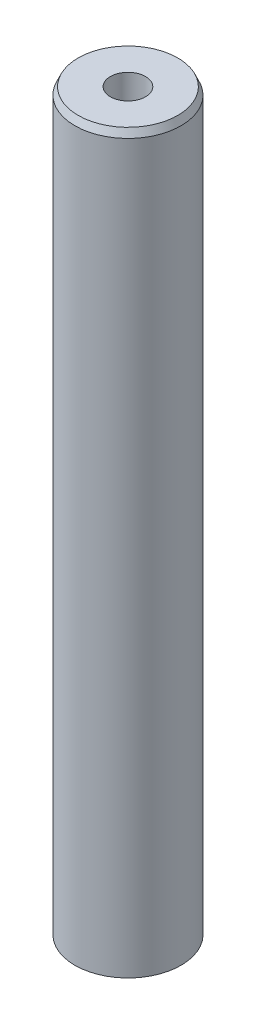
ISO-10303-21;
HEADER;
FILE_DESCRIPTION(('STEP AP214'),'2;1');
FILE_NAME('part.step','',(''),(''),'','','');
FILE_SCHEMA(('AUTOMOTIVE_DESIGN { 1 0 10303 214 1 1 1 1 }'));
ENDSEC;
DATA;
#1=APPLICATION_CONTEXT('core data for automotive mechanical design processes');
#2=APPLICATION_PROTOCOL_DEFINITION('international standard','automotive_design',2000,#1);
#3=PRODUCT_CONTEXT('',#1,'mechanical');
#4=PRODUCT('Part','Part','',(#3));
#5=PRODUCT_RELATED_PRODUCT_CATEGORY('part','',(#4));
#6=PRODUCT_DEFINITION_FORMATION('','',#4);
#7=PRODUCT_DEFINITION_CONTEXT('part definition',#1,'design');
#8=PRODUCT_DEFINITION('design','',#6,#7);
#9=PRODUCT_DEFINITION_SHAPE('','',#8);
#10=(LENGTH_UNIT() NAMED_UNIT(*) SI_UNIT(.MILLI.,.METRE.));
#11=(NAMED_UNIT(*) PLANE_ANGLE_UNIT() SI_UNIT($,.RADIAN.));
#12=(NAMED_UNIT(*) SI_UNIT($,.STERADIAN.) SOLID_ANGLE_UNIT());
#13=UNCERTAINTY_MEASURE_WITH_UNIT(LENGTH_MEASURE(1.E-05),#10,'distance_accuracy_value','');
#14=(GEOMETRIC_REPRESENTATION_CONTEXT(3) GLOBAL_UNCERTAINTY_ASSIGNED_CONTEXT((#13)) GLOBAL_UNIT_ASSIGNED_CONTEXT((#10,
#11,#12)) REPRESENTATION_CONTEXT('',''));
#15=CARTESIAN_POINT('',(0.,0.,0.));
#16=DIRECTION('',(0.,0.,1.));
#17=DIRECTION('',(1.,0.,0.));
#18=AXIS2_PLACEMENT_3D('',#15,#16,#17);
#19=CARTESIAN_POINT('',(0.,486.424898545537,0.));
#20=DIRECTION('',(0.,-1.,0.));
#21=DIRECTION('',(0.,0.,-1.));
#22=AXIS2_PLACEMENT_3D('',#19,#20,#21);
#23=CYLINDRICAL_SURFACE('',#22,35.);
#24=CARTESIAN_POINT('',(0.,481.596178537481,0.));
#25=DIRECTION('',(0.,1.,0.));
#26=DIRECTION('',(0.,0.,1.));
#27=AXIS2_PLACEMENT_3D('',#24,#25,#26);
#28=CIRCLE('',#27,35.);
#29=CARTESIAN_POINT('',(0.,481.596178537481,35.));
#30=VERTEX_POINT('',#29);
#31=EDGE_CURVE('E50',#30,#30,#28,.F.);
#32=ORIENTED_EDGE('',*,*,#31,.T.);
#33=EDGE_LOOP('',(#32));
#34=FACE_BOUND('',#33,.T.);
#35=CARTESIAN_POINT('',(0.,2.16018306188154,0.));
#36=DIRECTION('',(0.,1.,0.));
#37=DIRECTION('',(0.,0.,1.));
#38=AXIS2_PLACEMENT_3D('',#35,#36,#37);
#39=CIRCLE('',#38,35.);
#40=CARTESIAN_POINT('',(0.,2.16018306188154,35.));
#41=VERTEX_POINT('',#40);
#42=EDGE_CURVE('E51',#41,#41,#39,.T.);
#43=ORIENTED_EDGE('',*,*,#42,.T.);
#44=EDGE_LOOP('',(#43));
#45=FACE_BOUND('',#44,.T.);
#46=ADVANCED_FACE('F39',(#34,#45),#23,.T.);
#47=CARTESIAN_POINT('',(0.,486.424898545537,0.));
#48=DIRECTION('',(0.,1.,0.));
#49=DIRECTION('',(0.,0.,1.));
#50=AXIS2_PLACEMENT_3D('',#47,#48,#49);
#51=PLANE('',#50);
#52=CARTESIAN_POINT('',(0.,486.424898545537,0.));
#53=DIRECTION('',(0.,1.,0.));
#54=DIRECTION('',(0.,0.,1.));
#55=AXIS2_PLACEMENT_3D('',#52,#53,#54);
#56=CIRCLE('',#55,32.8398169381184);
#57=CARTESIAN_POINT('',(0.,486.424898545537,32.8398169381184));
#58=VERTEX_POINT('',#57);
#59=EDGE_CURVE('E54',#58,#58,#56,.T.);
#60=ORIENTED_EDGE('',*,*,#59,.T.);
#61=EDGE_LOOP('',(#60));
#62=FACE_BOUND('',#61,.T.);
#63=CARTESIAN_POINT('',(0.,486.424898545537,0.));
#64=DIRECTION('',(0.,1.,0.));
#65=DIRECTION('',(0.,0.,1.));
#66=AXIS2_PLACEMENT_3D('',#63,#64,#65);
#67=CIRCLE('',#66,11.5967435292074);
#68=CARTESIAN_POINT('',(0.,486.424898545537,11.5967435292074));
#69=VERTEX_POINT('',#68);
#70=EDGE_CURVE('E58',#69,#69,#67,.T.);
#71=ORIENTED_EDGE('',*,*,#70,.F.);
#72=EDGE_LOOP('',(#71));
#73=FACE_BOUND('',#72,.T.);
#74=ADVANCED_FACE('F69',(#62,#73),#51,.T.);
#75=CARTESIAN_POINT('',(0.,0.,0.));
#76=DIRECTION('',(0.,1.,0.));
#77=DIRECTION('',(0.,0.,1.));
#78=AXIS2_PLACEMENT_3D('',#75,#76,#77);
#79=PLANE('',#78);
#80=CARTESIAN_POINT('',(0.,0.,0.));
#81=DIRECTION('',(0.,1.,0.));
#82=DIRECTION('',(0.,0.,1.));
#83=AXIS2_PLACEMENT_3D('',#80,#81,#82);
#84=CIRCLE('',#83,30.1712799919439);
#85=CARTESIAN_POINT('',(0.,0.,30.1712799919439));
#86=VERTEX_POINT('',#85);
#87=EDGE_CURVE('E10',#86,#86,#84,.F.);
#88=ORIENTED_EDGE('',*,*,#87,.T.);
#89=EDGE_LOOP('',(#88));
#90=FACE_BOUND('',#89,.T.);
#91=CARTESIAN_POINT('',(0.,0.,0.));
#92=DIRECTION('',(0.,1.,0.));
#93=DIRECTION('',(0.,0.,1.));
#94=AXIS2_PLACEMENT_3D('',#91,#92,#93);
#95=CIRCLE('',#94,11.5967435292074);
#96=CARTESIAN_POINT('',(0.,0.,11.5967435292074));
#97=VERTEX_POINT('',#96);
#98=EDGE_CURVE('E63',#97,#97,#95,.T.);
#99=ORIENTED_EDGE('',*,*,#98,.T.);
#100=EDGE_LOOP('',(#99));
#101=FACE_BOUND('',#100,.T.);
#102=ADVANCED_FACE('F75',(#90,#101),#79,.F.);
#103=CARTESIAN_POINT('',(0.,486.424898545537,0.));
#104=DIRECTION('',(0.,-1.,0.));
#105=DIRECTION('',(0.,0.,-1.));
#106=AXIS2_PLACEMENT_3D('',#103,#104,#105);
#107=CYLINDRICAL_SURFACE('',#106,11.5967435292074);
#108=ORIENTED_EDGE('',*,*,#70,.T.);
#109=EDGE_LOOP('',(#108));
#110=FACE_BOUND('',#109,.T.);
#111=ORIENTED_EDGE('',*,*,#98,.F.);
#112=EDGE_LOOP('',(#111));
#113=FACE_BOUND('',#112,.T.);
#114=ADVANCED_FACE('F70',(#110,#113),#107,.F.);
#115=CARTESIAN_POINT('',(0.,486.424898545537,0.));
#116=DIRECTION('',(0.,-1.,0.));
#117=DIRECTION('',(0.,0.,-1.));
#118=AXIS2_PLACEMENT_3D('',#115,#116,#117);
#119=CONICAL_SURFACE('',#118,32.8398169381184,0.420657519427838);
#120=ORIENTED_EDGE('',*,*,#31,.F.);
#121=EDGE_LOOP('',(#120));
#122=FACE_BOUND('',#121,.T.);
#123=ORIENTED_EDGE('',*,*,#59,.F.);
#124=EDGE_LOOP('',(#123));
#125=FACE_BOUND('',#124,.T.);
#126=ADVANCED_FACE('F81',(#122,#125),#119,.T.);
#127=CARTESIAN_POINT('',(0.,2.16018306188154,0.));
#128=DIRECTION('',(0.,1.,0.));
#129=DIRECTION('',(0.,0.,1.));
#130=AXIS2_PLACEMENT_3D('',#127,#128,#129);
#131=CONICAL_SURFACE('',#130,35.,1.15013880736706);
#132=CARTESIAN_POINT('',(0.,0.,30.1712799919439));
#133=CARTESIAN_POINT('',(0.,0.0225019068945993,30.2215791586945));
#134=CARTESIAN_POINT('',(0.,0.0450038137891986,30.2718783254451));
#135=CARTESIAN_POINT('',(0.,0.0900076275783971,30.3724766589462));
#136=CARTESIAN_POINT('',(0.,0.112509534472996,30.4227758256968));
#137=CARTESIAN_POINT('',(0.,0.157513348262195,30.523374159198));
#138=CARTESIAN_POINT('',(0.,0.180015255156794,30.5736733259486));
#139=CARTESIAN_POINT('',(0.,0.225019068945993,30.6742716594498));
#140=CARTESIAN_POINT('',(0.,0.247520975840592,30.7245708262003));
#141=CARTESIAN_POINT('',(0.,0.292524789629791,30.8251691597015));
#142=CARTESIAN_POINT('',(0.,0.31502669652439,30.8754683264521));
#143=CARTESIAN_POINT('',(0.,0.360030510313589,30.9760666599533));
#144=CARTESIAN_POINT('',(0.,0.382532417208188,31.0263658267038));
#145=CARTESIAN_POINT('',(0.,0.427536230997387,31.126964160205));
#146=CARTESIAN_POINT('',(0.,0.450038137891986,31.1772633269556));
#147=CARTESIAN_POINT('',(0.,0.495041951681185,31.2778616604568));
#148=CARTESIAN_POINT('',(0.,0.517543858575784,31.3281608272074));
#149=CARTESIAN_POINT('',(0.,0.562547672364983,31.4287591607085));
#150=CARTESIAN_POINT('',(0.,0.585049579259582,31.4790583274591));
#151=CARTESIAN_POINT('',(0.,0.630053393048781,31.5796566609603));
#152=CARTESIAN_POINT('',(0.,0.652555299943381,31.6299558277109));
#153=CARTESIAN_POINT('',(0.,0.697559113732579,31.730554161212));
#154=CARTESIAN_POINT('',(0.,0.720061020627178,31.7808533279626));
#155=CARTESIAN_POINT('',(0.,0.765064834416377,31.8814516614638));
#156=CARTESIAN_POINT('',(0.,0.787566741310977,31.9317508282144));
#157=CARTESIAN_POINT('',(0.,0.832570555100175,32.0323491617155));
#158=CARTESIAN_POINT('',(0.,0.855072461994774,32.0826483284661));
#159=CARTESIAN_POINT('',(0.,0.900076275783973,32.1832466619673));
#160=CARTESIAN_POINT('',(0.,0.922578182678573,32.2335458287179));
#161=CARTESIAN_POINT('',(0.,0.967581996467772,32.334144162219));
#162=CARTESIAN_POINT('',(0.,0.990083903362371,32.3844433289696));
#163=CARTESIAN_POINT('',(0.,1.03508771715157,32.4850416624708));
#164=CARTESIAN_POINT('',(0.,1.05758962404617,32.5353408292214));
#165=CARTESIAN_POINT('',(0.,1.10259343783537,32.6359391627225));
#166=CARTESIAN_POINT('',(0.,1.12509534472997,32.6862383294731));
#167=CARTESIAN_POINT('',(0.,1.17009915851917,32.7868366629743));
#168=CARTESIAN_POINT('',(0.,1.19260106541377,32.8371358297249));
#169=CARTESIAN_POINT('',(0.,1.23760487920296,32.937734163226));
#170=CARTESIAN_POINT('',(0.,1.26010678609756,32.9880333299766));
#171=CARTESIAN_POINT('',(0.,1.30511059988676,33.0886316634778));
#172=CARTESIAN_POINT('',(0.,1.32761250678136,33.1389308302284));
#173=CARTESIAN_POINT('',(0.,1.37261632057056,33.2395291637296));
#174=CARTESIAN_POINT('',(0.,1.39511822746516,33.2898283304801));
#175=CARTESIAN_POINT('',(0.,1.44012204125436,33.3904266639813));
#176=CARTESIAN_POINT('',(0.,1.46262394814896,33.4407258307319));
#177=CARTESIAN_POINT('',(0.,1.50762776193816,33.5413241642331));
#178=CARTESIAN_POINT('',(0.,1.53012966883276,33.5916233309837));
#179=CARTESIAN_POINT('',(0.,1.57513348262195,33.6922216644848));
#180=CARTESIAN_POINT('',(0.,1.59763538951655,33.7425208312354));
#181=CARTESIAN_POINT('',(0.,1.64263920330575,33.8431191647366));
#182=CARTESIAN_POINT('',(0.,1.66514111020035,33.8934183314872));
#183=CARTESIAN_POINT('',(0.,1.71014492398955,33.9940166649883));
#184=CARTESIAN_POINT('',(0.,1.73264683088415,34.0443158317389));
#185=CARTESIAN_POINT('',(0.,1.77765064467335,34.1449141652401));
#186=CARTESIAN_POINT('',(0.,1.80015255156795,34.1952133319907));
#187=CARTESIAN_POINT('',(0.,1.84515636535715,34.2958116654918));
#188=CARTESIAN_POINT('',(0.,1.86765827225175,34.3461108322424));
#189=CARTESIAN_POINT('',(0.,1.91266208604094,34.4467091657436));
#190=CARTESIAN_POINT('',(0.,1.93516399293554,34.4970083324942));
#191=CARTESIAN_POINT('',(0.,1.98016780672474,34.5976066659953));
#192=CARTESIAN_POINT('',(0.,2.00266971361934,34.6479058327459));
#193=CARTESIAN_POINT('',(0.,2.04767352740854,34.7485041662471));
#194=CARTESIAN_POINT('',(0.,2.07017543430314,34.7988033329977));
#195=CARTESIAN_POINT('',(0.,2.11517924809234,34.8994016664988));
#196=CARTESIAN_POINT('',(0.,2.13768115498694,34.9497008332494));
#197=CARTESIAN_POINT('',(0.,2.16018306188154,35.));
#198=B_SPLINE_CURVE_WITH_KNOTS('',3,(#132,#133,#134,#135,#136,#137,#138,#139,#140,#141,#142,
#143,#144,#145,#146,#147,#148,#149,#150,#151,#152,#153,#154,#155,#156,#157,#158,#159,#160,#161,
#162,#163,#164,#165,#166,#167,#168,#169,#170,#171,#172,#173,#174,#175,#176,#177,#178,#179,#180,
#181,#182,#183,#184,#185,#186,#187,#188,#189,#190,#191,#192,#193,#194,#195,#196,#197),
.UNSPECIFIED.,.F.,.F.,(4,2,2,2,2,2,2,2,2,2,2,2,2,2,2,2,2,2,2,2,2,2,2,2,2,2,2,2,2,2,2,2,4),(0.,
0.165309037584961,0.330618075169925,0.495927112754888,0.661236150339852,0.826545187924813,
0.991854225509777,1.15716326309474,1.3224723006797,1.48778133826467,1.65309037584963,
1.8183994134346,1.98370845101956,2.14901748860452,2.31432652618948,2.47963556377444,
2.64494460135941,2.81025363894437,2.97556267652934,3.1408717141143,3.30618075169926,
3.47148978928423,3.63679882686919,3.80210786445416,3.96741690203912,4.13272593962408,
4.29803497720904,4.463344014794,4.62865305237897,4.79396208996393,4.9592711275489,
5.12458016513386,5.28988920271882),.UNSPECIFIED.);
#199=EDGE_CURVE('BSEAM45',#86,#41,#198,.T.);
#200=ORIENTED_EDGE('',*,*,#87,.F.);
#201=ORIENTED_EDGE('',*,*,#42,.F.);
#202=ORIENTED_EDGE('',*,*,#199,.T.);
#203=ORIENTED_EDGE('',*,*,#199,.F.);
#204=EDGE_LOOP('',(#200,#202,#201,#203));
#205=FACE_BOUND('',#204,.T.);
#206=ADVANCED_FACE('F45',(#205),#131,.T.);
#207=CLOSED_SHELL('',(#46,#74,#102,#114,#126,#206));
#208=MANIFOLD_SOLID_BREP('B2',#207);
#209=ADVANCED_BREP_SHAPE_REPRESENTATION('',(#18,#208),#14);
#210=SHAPE_DEFINITION_REPRESENTATION(#9,#209);
ENDSEC;
END-ISO-10303-21;
